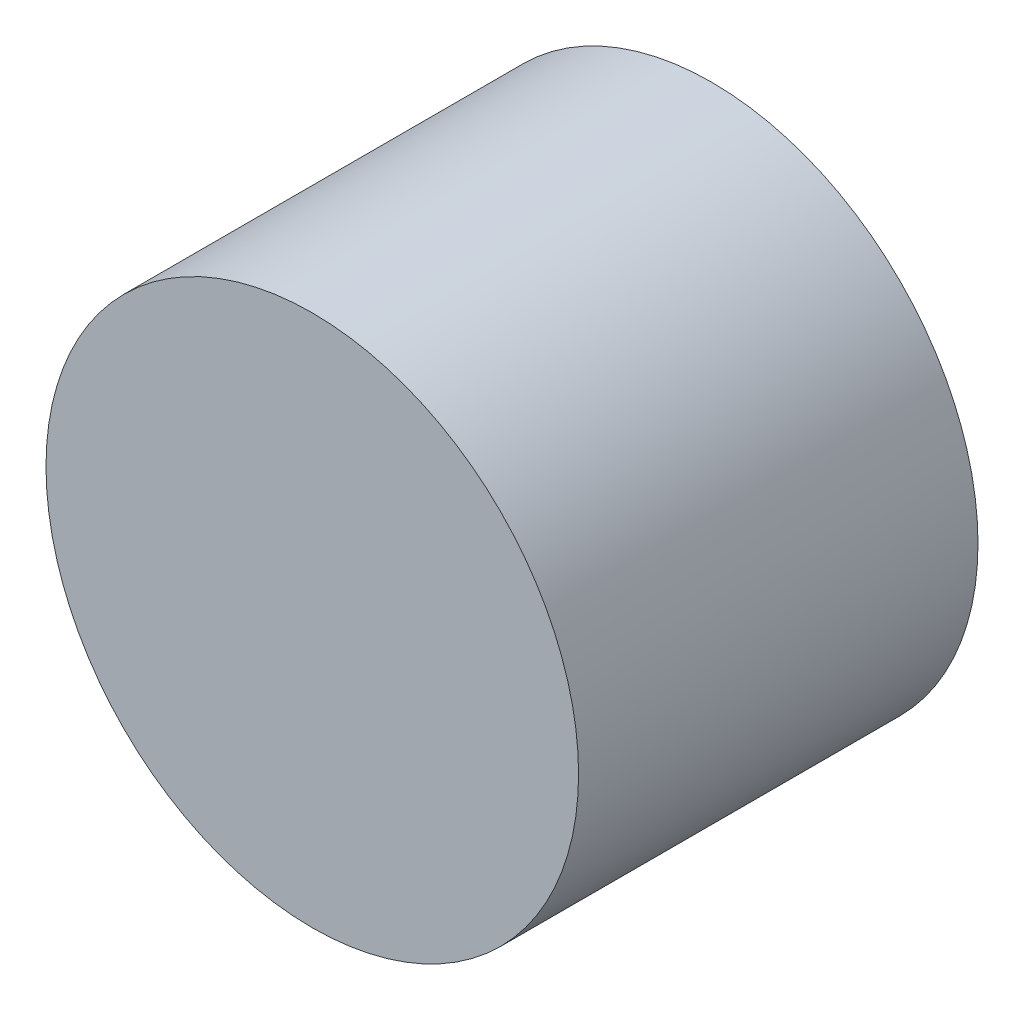
ISO-10303-21;
HEADER;
FILE_DESCRIPTION(('STEP AP214'),'2;1');
FILE_NAME('part.step','',(''),(''),'','','');
FILE_SCHEMA(('AUTOMOTIVE_DESIGN { 1 0 10303 214 1 1 1 1 }'));
ENDSEC;
DATA;
#1=APPLICATION_CONTEXT('core data for automotive mechanical design processes');
#2=APPLICATION_PROTOCOL_DEFINITION('international standard','automotive_design',2000,#1);
#3=PRODUCT_CONTEXT('',#1,'mechanical');
#4=PRODUCT('Part','Part','',(#3));
#5=PRODUCT_RELATED_PRODUCT_CATEGORY('part','',(#4));
#6=PRODUCT_DEFINITION_FORMATION('','',#4);
#7=PRODUCT_DEFINITION_CONTEXT('part definition',#1,'design');
#8=PRODUCT_DEFINITION('design','',#6,#7);
#9=PRODUCT_DEFINITION_SHAPE('','',#8);
#10=(LENGTH_UNIT() NAMED_UNIT(*) SI_UNIT(.MILLI.,.METRE.));
#11=(NAMED_UNIT(*) PLANE_ANGLE_UNIT() SI_UNIT($,.RADIAN.));
#12=(NAMED_UNIT(*) SI_UNIT($,.STERADIAN.) SOLID_ANGLE_UNIT());
#13=UNCERTAINTY_MEASURE_WITH_UNIT(LENGTH_MEASURE(1.E-05),#10,'distance_accuracy_value','');
#14=(GEOMETRIC_REPRESENTATION_CONTEXT(3) GLOBAL_UNCERTAINTY_ASSIGNED_CONTEXT((#13)) GLOBAL_UNIT_ASSIGNED_CONTEXT((#10,
#11,#12)) REPRESENTATION_CONTEXT('',''));
#15=CARTESIAN_POINT('',(0.,0.,0.));
#16=DIRECTION('',(0.,0.,1.));
#17=DIRECTION('',(1.,0.,0.));
#18=AXIS2_PLACEMENT_3D('',#15,#16,#17);
#19=CARTESIAN_POINT('',(0.,0.,6.));
#20=DIRECTION('',(0.,0.,-1.));
#21=DIRECTION('',(-1.,0.,0.));
#22=AXIS2_PLACEMENT_3D('',#19,#20,#21);
#23=CYLINDRICAL_SURFACE('',#22,4.);
#24=CARTESIAN_POINT('',(0.,0.,6.));
#25=DIRECTION('',(0.,0.,1.));
#26=DIRECTION('',(1.,0.,0.));
#27=AXIS2_PLACEMENT_3D('',#24,#25,#26);
#28=CIRCLE('',#27,4.);
#29=CARTESIAN_POINT('',(4.,0.,6.));
#30=VERTEX_POINT('',#29);
#31=EDGE_CURVE('E11',#30,#30,#28,.T.);
#32=ORIENTED_EDGE('',*,*,#31,.F.);
#33=EDGE_LOOP('',(#32));
#34=FACE_BOUND('',#33,.T.);
#35=CARTESIAN_POINT('',(0.,0.,0.));
#36=DIRECTION('',(0.,0.,1.));
#37=DIRECTION('',(1.,0.,0.));
#38=AXIS2_PLACEMENT_3D('',#35,#36,#37);
#39=CIRCLE('',#38,4.);
#40=CARTESIAN_POINT('',(4.,0.,0.));
#41=VERTEX_POINT('',#40);
#42=EDGE_CURVE('E35',#41,#41,#39,.T.);
#43=ORIENTED_EDGE('',*,*,#42,.T.);
#44=EDGE_LOOP('',(#43));
#45=FACE_BOUND('',#44,.T.);
#46=ADVANCED_FACE('F32',(#34,#45),#23,.T.);
#47=CARTESIAN_POINT('',(0.,0.,6.));
#48=DIRECTION('',(0.,0.,1.));
#49=DIRECTION('',(1.,0.,0.));
#50=AXIS2_PLACEMENT_3D('',#47,#48,#49);
#51=PLANE('',#50);
#52=ORIENTED_EDGE('',*,*,#31,.T.);
#53=EDGE_LOOP('',(#52));
#54=FACE_BOUND('',#53,.T.);
#55=ADVANCED_FACE('F157',(#54),#51,.T.);
#56=CARTESIAN_POINT('',(0.,0.,0.));
#57=DIRECTION('',(0.,0.,1.));
#58=DIRECTION('',(1.,0.,0.));
#59=AXIS2_PLACEMENT_3D('',#56,#57,#58);
#60=PLANE('',#59);
#61=DIRECTION('',(0.473303337202763,0.880899512426206,0.));
#62=VECTOR('',#61,1.);
#63=CARTESIAN_POINT('',(-2.99859907363141,-0.0916711274986719,0.));
#64=LINE('',#63,#62);
#65=CARTESIAN_POINT('',(-2.99859907363141,-0.091671127498672,0.));
#66=VERTEX_POINT('',#65);
#67=CARTESIAN_POINT('',(-1.57868906202312,2.55102740977995,0.));
#68=VERTEX_POINT('',#67);
#69=EDGE_CURVE('E120',#66,#68,#64,.T.);
#70=ORIENTED_EDGE('',*,*,#69,.F.);
#71=DIRECTION('',(-0.526229687341038,0.850342469926649,0.));
#72=VECTOR('',#71,1.);
#73=CARTESIAN_POINT('',(-1.41991001160829,-2.64269853727862,0.));
#74=LINE('',#73,#72);
#75=CARTESIAN_POINT('',(-1.41991001160829,-2.64269853727862,0.));
#76=VERTEX_POINT('',#75);
#77=EDGE_CURVE('E46',#76,#66,#74,.T.);
#78=ORIENTED_EDGE('',*,*,#77,.F.);
#79=DIRECTION('',(-0.999533024543802,-0.0305570424995576,0.));
#80=VECTOR('',#79,1.);
#81=CARTESIAN_POINT('',(1.57868906202312,-2.55102740977995,0.));
#82=LINE('',#81,#80);
#83=CARTESIAN_POINT('',(1.57868906202312,-2.55102740977995,0.));
#84=VERTEX_POINT('',#83);
#85=EDGE_CURVE('E129',#84,#76,#82,.T.);
#86=ORIENTED_EDGE('',*,*,#85,.F.);
#87=DIRECTION('',(-0.473303337202763,-0.880899512426206,0.));
#88=VECTOR('',#87,1.);
#89=CARTESIAN_POINT('',(2.99859907363141,0.0916711274986722,0.));
#90=LINE('',#89,#88);
#91=CARTESIAN_POINT('',(2.99859907363141,0.0916711274986722,0.));
#92=VERTEX_POINT('',#91);
#93=EDGE_CURVE('E127',#92,#84,#90,.T.);
#94=ORIENTED_EDGE('',*,*,#93,.F.);
#95=DIRECTION('',(0.526229687341038,-0.850342469926648,0.));
#96=VECTOR('',#95,1.);
#97=CARTESIAN_POINT('',(1.41991001160829,2.64269853727862,0.));
#98=LINE('',#97,#96);
#99=CARTESIAN_POINT('',(1.41991001160829,2.64269853727862,0.));
#100=VERTEX_POINT('',#99);
#101=EDGE_CURVE('E94',#100,#92,#98,.T.);
#102=ORIENTED_EDGE('',*,*,#101,.F.);
#103=DIRECTION('',(0.999533024543802,0.0305570424995576,0.));
#104=VECTOR('',#103,1.);
#105=CARTESIAN_POINT('',(-1.57868906202312,2.55102740977995,0.));
#106=LINE('',#105,#104);
#107=EDGE_CURVE('E123',#68,#100,#106,.T.);
#108=ORIENTED_EDGE('',*,*,#107,.F.);
#109=EDGE_LOOP('',(#70,#78,#86,#94,#102,#108));
#110=FACE_BOUND('',#109,.T.);
#111=ORIENTED_EDGE('',*,*,#42,.F.);
#112=EDGE_LOOP('',(#111));
#113=FACE_BOUND('',#112,.T.);
#114=ADVANCED_FACE('F142',(#110,#113),#60,.F.);
#115=CARTESIAN_POINT('',(-1.41991001160829,-2.64269853727862,3.));
#116=DIRECTION('',(-0.850342469926648,-0.526229687341038,0.));
#117=DIRECTION('',(0.526229687341038,-0.850342469926649,0.));
#118=AXIS2_PLACEMENT_3D('',#115,#116,#117);
#119=PLANE('',#118);
#120=ORIENTED_EDGE('',*,*,#77,.T.);
#121=DIRECTION('',(0.,0.,-1.));
#122=VECTOR('',#121,1.);
#123=CARTESIAN_POINT('',(-2.99859907363141,-0.0916711274986719,3.));
#124=LINE('',#123,#122);
#125=CARTESIAN_POINT('',(-2.99859907363141,-0.0916711274986719,3.));
#126=VERTEX_POINT('',#125);
#127=EDGE_CURVE('E76',#126,#66,#124,.T.);
#128=ORIENTED_EDGE('',*,*,#127,.F.);
#129=DIRECTION('',(-0.526229687341038,0.850342469926649,0.));
#130=VECTOR('',#129,1.);
#131=CARTESIAN_POINT('',(-1.41991001160829,-2.64269853727862,3.));
#132=LINE('',#131,#130);
#133=CARTESIAN_POINT('',(-1.41991001160829,-2.64269853727862,3.));
#134=VERTEX_POINT('',#133);
#135=EDGE_CURVE('E131',#134,#126,#132,.T.);
#136=ORIENTED_EDGE('',*,*,#135,.F.);
#137=DIRECTION('',(0.,0.,-1.));
#138=VECTOR('',#137,1.);
#139=CARTESIAN_POINT('',(-1.41991001160829,-2.64269853727862,3.));
#140=LINE('',#139,#138);
#141=EDGE_CURVE('E54',#134,#76,#140,.T.);
#142=ORIENTED_EDGE('',*,*,#141,.T.);
#143=EDGE_LOOP('',(#120,#128,#136,#142));
#144=FACE_BOUND('',#143,.T.);
#145=ADVANCED_FACE('F148',(#144),#119,.F.);
#146=CARTESIAN_POINT('',(1.57868906202312,-2.55102740977995,3.));
#147=DIRECTION('',(0.0305570424995576,-0.999533024543802,0.));
#148=DIRECTION('',(0.999533024543802,0.0305570424995576,0.));
#149=AXIS2_PLACEMENT_3D('',#146,#147,#148);
#150=PLANE('',#149);
#151=ORIENTED_EDGE('',*,*,#85,.T.);
#152=ORIENTED_EDGE('',*,*,#141,.F.);
#153=DIRECTION('',(-0.999533024543802,-0.0305570424995576,0.));
#154=VECTOR('',#153,1.);
#155=CARTESIAN_POINT('',(1.57868906202312,-2.55102740977995,3.));
#156=LINE('',#155,#154);
#157=CARTESIAN_POINT('',(1.57868906202312,-2.55102740977995,3.));
#158=VERTEX_POINT('',#157);
#159=EDGE_CURVE('E106',#158,#134,#156,.T.);
#160=ORIENTED_EDGE('',*,*,#159,.F.);
#161=DIRECTION('',(0.,0.,-1.));
#162=VECTOR('',#161,1.);
#163=CARTESIAN_POINT('',(1.57868906202312,-2.55102740977995,3.));
#164=LINE('',#163,#162);
#165=EDGE_CURVE('E98',#158,#84,#164,.T.);
#166=ORIENTED_EDGE('',*,*,#165,.T.);
#167=EDGE_LOOP('',(#151,#152,#160,#166));
#168=FACE_BOUND('',#167,.T.);
#169=ADVANCED_FACE('F150',(#168),#150,.F.);
#170=CARTESIAN_POINT('',(2.99859907363141,0.0916711274986722,3.));
#171=DIRECTION('',(0.880899512426206,-0.473303337202763,0.));
#172=DIRECTION('',(0.473303337202763,0.880899512426206,0.));
#173=AXIS2_PLACEMENT_3D('',#170,#171,#172);
#174=PLANE('',#173);
#175=ORIENTED_EDGE('',*,*,#93,.T.);
#176=ORIENTED_EDGE('',*,*,#165,.F.);
#177=DIRECTION('',(-0.473303337202763,-0.880899512426206,0.));
#178=VECTOR('',#177,1.);
#179=CARTESIAN_POINT('',(2.99859907363141,0.0916711274986722,3.));
#180=LINE('',#179,#178);
#181=CARTESIAN_POINT('',(2.99859907363141,0.0916711274986722,3.));
#182=VERTEX_POINT('',#181);
#183=EDGE_CURVE('E102',#182,#158,#180,.T.);
#184=ORIENTED_EDGE('',*,*,#183,.F.);
#185=DIRECTION('',(0.,0.,-1.));
#186=VECTOR('',#185,1.);
#187=CARTESIAN_POINT('',(2.99859907363141,0.0916711274986722,3.));
#188=LINE('',#187,#186);
#189=EDGE_CURVE('E87',#182,#92,#188,.T.);
#190=ORIENTED_EDGE('',*,*,#189,.T.);
#191=EDGE_LOOP('',(#175,#176,#184,#190));
#192=FACE_BOUND('',#191,.T.);
#193=ADVANCED_FACE('F103',(#192),#174,.F.);
#194=CARTESIAN_POINT('',(1.41991001160829,2.64269853727862,3.));
#195=DIRECTION('',(0.850342469926648,0.526229687341038,0.));
#196=DIRECTION('',(-0.526229687341038,0.850342469926649,0.));
#197=AXIS2_PLACEMENT_3D('',#194,#195,#196);
#198=PLANE('',#197);
#199=ORIENTED_EDGE('',*,*,#101,.T.);
#200=ORIENTED_EDGE('',*,*,#189,.F.);
#201=DIRECTION('',(0.526229687341038,-0.850342469926648,0.));
#202=VECTOR('',#201,1.);
#203=CARTESIAN_POINT('',(1.41991001160829,2.64269853727862,3.));
#204=LINE('',#203,#202);
#205=CARTESIAN_POINT('',(1.41991001160829,2.64269853727862,3.));
#206=VERTEX_POINT('',#205);
#207=EDGE_CURVE('E91',#206,#182,#204,.T.);
#208=ORIENTED_EDGE('',*,*,#207,.F.);
#209=DIRECTION('',(0.,0.,-1.));
#210=VECTOR('',#209,1.);
#211=CARTESIAN_POINT('',(1.41991001160829,2.64269853727862,3.));
#212=LINE('',#211,#210);
#213=EDGE_CURVE('E99',#206,#100,#212,.T.);
#214=ORIENTED_EDGE('',*,*,#213,.T.);
#215=EDGE_LOOP('',(#199,#200,#208,#214));
#216=FACE_BOUND('',#215,.T.);
#217=ADVANCED_FACE('F89',(#216),#198,.F.);
#218=CARTESIAN_POINT('',(-1.57868906202312,2.55102740977995,3.));
#219=DIRECTION('',(-0.0305570424995576,0.999533024543802,0.));
#220=DIRECTION('',(-0.999533024543802,-0.0305570424995576,0.));
#221=AXIS2_PLACEMENT_3D('',#218,#219,#220);
#222=PLANE('',#221);
#223=ORIENTED_EDGE('',*,*,#107,.T.);
#224=ORIENTED_EDGE('',*,*,#213,.F.);
#225=DIRECTION('',(0.999533024543802,0.0305570424995576,0.));
#226=VECTOR('',#225,1.);
#227=CARTESIAN_POINT('',(-1.57868906202312,2.55102740977995,3.));
#228=LINE('',#227,#226);
#229=CARTESIAN_POINT('',(-1.57868906202312,2.55102740977995,3.));
#230=VERTEX_POINT('',#229);
#231=EDGE_CURVE('E112',#230,#206,#228,.T.);
#232=ORIENTED_EDGE('',*,*,#231,.F.);
#233=DIRECTION('',(0.,0.,-1.));
#234=VECTOR('',#233,1.);
#235=CARTESIAN_POINT('',(-1.57868906202312,2.55102740977995,3.));
#236=LINE('',#235,#234);
#237=EDGE_CURVE('E135',#230,#68,#236,.T.);
#238=ORIENTED_EDGE('',*,*,#237,.T.);
#239=EDGE_LOOP('',(#223,#224,#232,#238));
#240=FACE_BOUND('',#239,.T.);
#241=ADVANCED_FACE('F146',(#240),#222,.F.);
#242=CARTESIAN_POINT('',(-2.99859907363141,-0.0916711274986719,3.));
#243=DIRECTION('',(-0.880899512426206,0.473303337202763,0.));
#244=DIRECTION('',(-0.473303337202763,-0.880899512426206,0.));
#245=AXIS2_PLACEMENT_3D('',#242,#243,#244);
#246=PLANE('',#245);
#247=ORIENTED_EDGE('',*,*,#69,.T.);
#248=ORIENTED_EDGE('',*,*,#237,.F.);
#249=DIRECTION('',(0.473303337202763,0.880899512426206,0.));
#250=VECTOR('',#249,1.);
#251=CARTESIAN_POINT('',(-2.99859907363141,-0.0916711274986719,3.));
#252=LINE('',#251,#250);
#253=EDGE_CURVE('E114',#126,#230,#252,.T.);
#254=ORIENTED_EDGE('',*,*,#253,.F.);
#255=ORIENTED_EDGE('',*,*,#127,.T.);
#256=EDGE_LOOP('',(#247,#248,#254,#255));
#257=FACE_BOUND('',#256,.T.);
#258=ADVANCED_FACE('F139',(#257),#246,.F.);
#259=CARTESIAN_POINT('',(-2.9985990736314,-0.0916711274986713,3.));
#260=DIRECTION('',(0.,0.,-1.));
#261=DIRECTION('',(-1.,0.,0.));
#262=AXIS2_PLACEMENT_3D('',#259,#260,#261);
#263=PLANE('',#262);
#264=ORIENTED_EDGE('',*,*,#135,.T.);
#265=ORIENTED_EDGE('',*,*,#253,.T.);
#266=ORIENTED_EDGE('',*,*,#231,.T.);
#267=ORIENTED_EDGE('',*,*,#207,.T.);
#268=ORIENTED_EDGE('',*,*,#183,.T.);
#269=ORIENTED_EDGE('',*,*,#159,.T.);
#270=EDGE_LOOP('',(#264,#265,#266,#267,#268,#269));
#271=FACE_BOUND('',#270,.T.);
#272=ADVANCED_FACE('F109',(#271),#263,.T.);
#273=CLOSED_SHELL('',(#46,#55,#114,#145,#169,#193,#217,#241,#258,#272));
#274=MANIFOLD_SOLID_BREP('B2',#273);
#275=ADVANCED_BREP_SHAPE_REPRESENTATION('',(#18,#274),#14);
#276=SHAPE_DEFINITION_REPRESENTATION(#9,#275);
ENDSEC;
END-ISO-10303-21;
